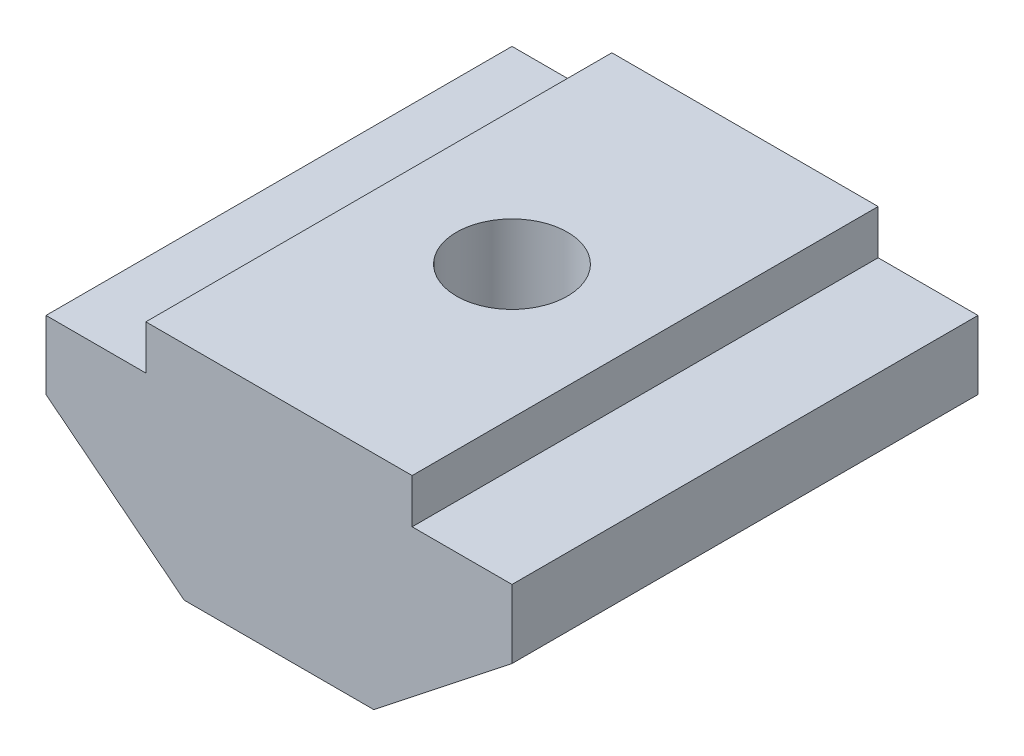
ISO-10303-21;
HEADER;
FILE_DESCRIPTION(('STEP AP214'),'2;1');
FILE_NAME('part.step','',(''),(''),'','','');
FILE_SCHEMA(('AUTOMOTIVE_DESIGN { 1 0 10303 214 1 1 1 1 }'));
ENDSEC;
DATA;
#1=APPLICATION_CONTEXT('core data for automotive mechanical design processes');
#2=APPLICATION_PROTOCOL_DEFINITION('international standard','automotive_design',2000,#1);
#3=PRODUCT_CONTEXT('',#1,'mechanical');
#4=PRODUCT('Part','Part','',(#3));
#5=PRODUCT_RELATED_PRODUCT_CATEGORY('part','',(#4));
#6=PRODUCT_DEFINITION_FORMATION('','',#4);
#7=PRODUCT_DEFINITION_CONTEXT('part definition',#1,'design');
#8=PRODUCT_DEFINITION('design','',#6,#7);
#9=PRODUCT_DEFINITION_SHAPE('','',#8);
#10=(LENGTH_UNIT() NAMED_UNIT(*) SI_UNIT(.MILLI.,.METRE.));
#11=(NAMED_UNIT(*) PLANE_ANGLE_UNIT() SI_UNIT($,.RADIAN.));
#12=(NAMED_UNIT(*) SI_UNIT($,.STERADIAN.) SOLID_ANGLE_UNIT());
#13=UNCERTAINTY_MEASURE_WITH_UNIT(LENGTH_MEASURE(1.E-05),#10,'distance_accuracy_value','');
#14=(GEOMETRIC_REPRESENTATION_CONTEXT(3) GLOBAL_UNCERTAINTY_ASSIGNED_CONTEXT((#13)) GLOBAL_UNIT_ASSIGNED_CONTEXT((#10,
#11,#12)) REPRESENTATION_CONTEXT('',''));
#15=CARTESIAN_POINT('',(0.,0.,0.));
#16=DIRECTION('',(0.,0.,1.));
#17=DIRECTION('',(1.,0.,0.));
#18=AXIS2_PLACEMENT_3D('',#15,#16,#17);
#19=CARTESIAN_POINT('',(3.,5.,10.5));
#20=DIRECTION('',(-1.,0.,0.));
#21=DIRECTION('',(0.,-1.,0.));
#22=AXIS2_PLACEMENT_3D('',#19,#20,#21);
#23=PLANE('',#22);
#24=DIRECTION('',(0.,1.,0.));
#25=VECTOR('',#24,1.);
#26=CARTESIAN_POINT('',(3.,5.,0.));
#27=LINE('',#26,#25);
#28=CARTESIAN_POINT('',(3.,4.,0.));
#29=VERTEX_POINT('',#28);
#30=CARTESIAN_POINT('',(3.,5.,0.));
#31=VERTEX_POINT('',#30);
#32=EDGE_CURVE('E158',#29,#31,#27,.T.);
#33=ORIENTED_EDGE('',*,*,#32,.T.);
#34=DIRECTION('',(0.,0.,-1.));
#35=VECTOR('',#34,1.);
#36=CARTESIAN_POINT('',(3.,5.,10.5));
#37=LINE('',#36,#35);
#38=CARTESIAN_POINT('',(3.,5.,10.5));
#39=VERTEX_POINT('',#38);
#40=EDGE_CURVE('E13',#39,#31,#37,.T.);
#41=ORIENTED_EDGE('',*,*,#40,.F.);
#42=DIRECTION('',(0.,1.,0.));
#43=VECTOR('',#42,1.);
#44=CARTESIAN_POINT('',(3.,5.,10.5));
#45=LINE('',#44,#43);
#46=CARTESIAN_POINT('',(3.,4.,10.5));
#47=VERTEX_POINT('',#46);
#48=EDGE_CURVE('E177',#47,#39,#45,.T.);
#49=ORIENTED_EDGE('',*,*,#48,.F.);
#50=DIRECTION('',(0.,0.,-1.));
#51=VECTOR('',#50,1.);
#52=CARTESIAN_POINT('',(3.,4.,10.5));
#53=LINE('',#52,#51);
#54=EDGE_CURVE('E154',#47,#29,#53,.T.);
#55=ORIENTED_EDGE('',*,*,#54,.T.);
#56=EDGE_LOOP('',(#33,#41,#49,#55));
#57=FACE_BOUND('',#56,.T.);
#58=ADVANCED_FACE('F50',(#57),#23,.F.);
#59=CARTESIAN_POINT('',(-3.,5.,10.5));
#60=DIRECTION('',(0.,-1.,0.));
#61=DIRECTION('',(0.,0.,-1.));
#62=AXIS2_PLACEMENT_3D('',#59,#60,#61);
#63=PLANE('',#62);
#64=CARTESIAN_POINT('',(0.,5.,5.24999999999998));
#65=DIRECTION('',(0.,1.,0.));
#66=DIRECTION('',(0.,0.,1.));
#67=AXIS2_PLACEMENT_3D('',#64,#65,#66);
#68=CIRCLE('',#67,1.25);
#69=CARTESIAN_POINT('',(0.,5.,6.49999999999998));
#70=VERTEX_POINT('',#69);
#71=EDGE_CURVE('E226',#70,#70,#68,.T.);
#72=ORIENTED_EDGE('',*,*,#71,.F.);
#73=EDGE_LOOP('',(#72));
#74=FACE_BOUND('',#73,.T.);
#75=DIRECTION('',(-1.,0.,0.));
#76=VECTOR('',#75,1.);
#77=CARTESIAN_POINT('',(-3.,5.,0.));
#78=LINE('',#77,#76);
#79=CARTESIAN_POINT('',(-3.,5.,0.));
#80=VERTEX_POINT('',#79);
#81=EDGE_CURVE('E161',#31,#80,#78,.T.);
#82=ORIENTED_EDGE('',*,*,#81,.T.);
#83=DIRECTION('',(0.,0.,-1.));
#84=VECTOR('',#83,1.);
#85=CARTESIAN_POINT('',(-3.,5.,10.5));
#86=LINE('',#85,#84);
#87=CARTESIAN_POINT('',(-3.,5.,10.5));
#88=VERTEX_POINT('',#87);
#89=EDGE_CURVE('E58',#88,#80,#86,.T.);
#90=ORIENTED_EDGE('',*,*,#89,.F.);
#91=DIRECTION('',(-1.,0.,0.));
#92=VECTOR('',#91,1.);
#93=CARTESIAN_POINT('',(-3.,5.,10.5));
#94=LINE('',#93,#92);
#95=EDGE_CURVE('E115',#39,#88,#94,.T.);
#96=ORIENTED_EDGE('',*,*,#95,.F.);
#97=ORIENTED_EDGE('',*,*,#40,.T.);
#98=EDGE_LOOP('',(#82,#90,#96,#97));
#99=FACE_BOUND('',#98,.T.);
#100=ADVANCED_FACE('F232',(#74,#99),#63,.F.);
#101=CARTESIAN_POINT('',(-3.,5.,10.5));
#102=DIRECTION('',(1.,0.,0.));
#103=DIRECTION('',(0.,1.,0.));
#104=AXIS2_PLACEMENT_3D('',#101,#102,#103);
#105=PLANE('',#104);
#106=DIRECTION('',(0.,-1.,0.));
#107=VECTOR('',#106,1.);
#108=CARTESIAN_POINT('',(-3.,5.,0.));
#109=LINE('',#108,#107);
#110=CARTESIAN_POINT('',(-3.,4.,0.));
#111=VERTEX_POINT('',#110);
#112=EDGE_CURVE('E164',#80,#111,#109,.T.);
#113=ORIENTED_EDGE('',*,*,#112,.T.);
#114=DIRECTION('',(0.,0.,-1.));
#115=VECTOR('',#114,1.);
#116=CARTESIAN_POINT('',(-3.,4.,10.5));
#117=LINE('',#116,#115);
#118=CARTESIAN_POINT('',(-3.,4.,10.5));
#119=VERTEX_POINT('',#118);
#120=EDGE_CURVE('E190',#119,#111,#117,.T.);
#121=ORIENTED_EDGE('',*,*,#120,.F.);
#122=DIRECTION('',(0.,-1.,0.));
#123=VECTOR('',#122,1.);
#124=CARTESIAN_POINT('',(-3.,5.,10.5));
#125=LINE('',#124,#123);
#126=EDGE_CURVE('E198',#88,#119,#125,.T.);
#127=ORIENTED_EDGE('',*,*,#126,.F.);
#128=ORIENTED_EDGE('',*,*,#89,.T.);
#129=EDGE_LOOP('',(#113,#121,#127,#128));
#130=FACE_BOUND('',#129,.T.);
#131=ADVANCED_FACE('F196',(#130),#105,.F.);
#132=CARTESIAN_POINT('',(-3.,4.,10.5));
#133=DIRECTION('',(0.,-1.,0.));
#134=DIRECTION('',(0.,0.,-1.));
#135=AXIS2_PLACEMENT_3D('',#132,#133,#134);
#136=PLANE('',#135);
#137=DIRECTION('',(-1.,0.,0.));
#138=VECTOR('',#137,1.);
#139=CARTESIAN_POINT('',(-3.,4.,0.));
#140=LINE('',#139,#138);
#141=CARTESIAN_POINT('',(-5.24999999999998,4.,0.));
#142=VERTEX_POINT('',#141);
#143=EDGE_CURVE('E166',#111,#142,#140,.T.);
#144=ORIENTED_EDGE('',*,*,#143,.T.);
#145=DIRECTION('',(0.,0.,-1.));
#146=VECTOR('',#145,1.);
#147=CARTESIAN_POINT('',(-5.24999999999998,4.,10.5));
#148=LINE('',#147,#146);
#149=CARTESIAN_POINT('',(-5.24999999999998,4.,10.5));
#150=VERTEX_POINT('',#149);
#151=EDGE_CURVE('E187',#150,#142,#148,.T.);
#152=ORIENTED_EDGE('',*,*,#151,.F.);
#153=DIRECTION('',(-1.,0.,0.));
#154=VECTOR('',#153,1.);
#155=CARTESIAN_POINT('',(-3.,4.,10.5));
#156=LINE('',#155,#154);
#157=EDGE_CURVE('E216',#119,#150,#156,.T.);
#158=ORIENTED_EDGE('',*,*,#157,.F.);
#159=ORIENTED_EDGE('',*,*,#120,.T.);
#160=EDGE_LOOP('',(#144,#152,#158,#159));
#161=FACE_BOUND('',#160,.T.);
#162=ADVANCED_FACE('F207',(#161),#136,.F.);
#163=CARTESIAN_POINT('',(-5.24999999999998,4.,10.5));
#164=DIRECTION('',(1.,0.,0.));
#165=DIRECTION('',(0.,0.,-1.));
#166=AXIS2_PLACEMENT_3D('',#163,#164,#165);
#167=PLANE('',#166);
#168=DIRECTION('',(0.,-1.,0.));
#169=VECTOR('',#168,1.);
#170=CARTESIAN_POINT('',(-5.24999999999998,4.,0.));
#171=LINE('',#170,#169);
#172=CARTESIAN_POINT('',(-5.24999999999998,2.45593869111821,0.));
#173=VERTEX_POINT('',#172);
#174=EDGE_CURVE('E168',#142,#173,#171,.T.);
#175=ORIENTED_EDGE('',*,*,#174,.T.);
#176=DIRECTION('',(0.,0.,-1.));
#177=VECTOR('',#176,1.);
#178=CARTESIAN_POINT('',(-5.24999999999998,2.45593869111821,10.5));
#179=LINE('',#178,#177);
#180=CARTESIAN_POINT('',(-5.24999999999998,2.45593869111821,10.5));
#181=VERTEX_POINT('',#180);
#182=EDGE_CURVE('E184',#181,#173,#179,.T.);
#183=ORIENTED_EDGE('',*,*,#182,.F.);
#184=DIRECTION('',(0.,-1.,0.));
#185=VECTOR('',#184,1.);
#186=CARTESIAN_POINT('',(-5.24999999999998,4.,10.5));
#187=LINE('',#186,#185);
#188=EDGE_CURVE('E213',#150,#181,#187,.T.);
#189=ORIENTED_EDGE('',*,*,#188,.F.);
#190=ORIENTED_EDGE('',*,*,#151,.T.);
#191=EDGE_LOOP('',(#175,#183,#189,#190));
#192=FACE_BOUND('',#191,.T.);
#193=ADVANCED_FACE('F211',(#192),#167,.F.);
#194=CARTESIAN_POINT('',(-5.24999999999998,2.45593869111821,10.5));
#195=DIRECTION('',(0.619208751305956,0.78522641467676,0.));
#196=DIRECTION('',(-0.78522641467676,0.619208751305956,0.));
#197=AXIS2_PLACEMENT_3D('',#194,#195,#196);
#198=PLANE('',#197);
#199=DIRECTION('',(0.78522641467676,-0.619208751305956,0.));
#200=VECTOR('',#199,1.);
#201=CARTESIAN_POINT('',(-5.24999999999998,2.45593869111821,0.));
#202=LINE('',#201,#200);
#203=CARTESIAN_POINT('',(-2.13559322033896,0.,0.));
#204=VERTEX_POINT('',#203);
#205=EDGE_CURVE('E170',#173,#204,#202,.T.);
#206=ORIENTED_EDGE('',*,*,#205,.T.);
#207=DIRECTION('',(0.,0.,-1.));
#208=VECTOR('',#207,1.);
#209=CARTESIAN_POINT('',(-2.13559322033896,0.,10.5));
#210=LINE('',#209,#208);
#211=CARTESIAN_POINT('',(-2.13559322033896,0.,10.5));
#212=VERTEX_POINT('',#211);
#213=EDGE_CURVE('E181',#212,#204,#210,.T.);
#214=ORIENTED_EDGE('',*,*,#213,.F.);
#215=DIRECTION('',(0.78522641467676,-0.619208751305956,0.));
#216=VECTOR('',#215,1.);
#217=CARTESIAN_POINT('',(-5.24999999999998,2.45593869111821,10.5));
#218=LINE('',#217,#216);
#219=EDGE_CURVE('E215',#181,#212,#218,.T.);
#220=ORIENTED_EDGE('',*,*,#219,.F.);
#221=ORIENTED_EDGE('',*,*,#182,.T.);
#222=EDGE_LOOP('',(#206,#214,#220,#221));
#223=FACE_BOUND('',#222,.T.);
#224=ADVANCED_FACE('F242',(#223),#198,.F.);
#225=CARTESIAN_POINT('',(2.13559322033896,0.,10.5));
#226=DIRECTION('',(0.,1.,0.));
#227=DIRECTION('',(0.,0.,1.));
#228=AXIS2_PLACEMENT_3D('',#225,#226,#227);
#229=PLANE('',#228);
#230=CARTESIAN_POINT('',(0.,0.,5.24999999999998));
#231=DIRECTION('',(0.,1.,0.));
#232=DIRECTION('',(0.,0.,1.));
#233=AXIS2_PLACEMENT_3D('',#230,#231,#232);
#234=CIRCLE('',#233,1.25);
#235=CARTESIAN_POINT('',(0.,0.,6.49999999999997));
#236=VERTEX_POINT('',#235);
#237=EDGE_CURVE('E162',#236,#236,#234,.T.);
#238=ORIENTED_EDGE('',*,*,#237,.T.);
#239=EDGE_LOOP('',(#238));
#240=FACE_BOUND('',#239,.T.);
#241=DIRECTION('',(1.,0.,0.));
#242=VECTOR('',#241,1.);
#243=CARTESIAN_POINT('',(2.13559322033896,0.,0.));
#244=LINE('',#243,#242);
#245=CARTESIAN_POINT('',(2.13559322033896,0.,0.));
#246=VERTEX_POINT('',#245);
#247=EDGE_CURVE('E172',#204,#246,#244,.T.);
#248=ORIENTED_EDGE('',*,*,#247,.T.);
#249=DIRECTION('',(0.,0.,-1.));
#250=VECTOR('',#249,1.);
#251=CARTESIAN_POINT('',(2.13559322033896,0.,10.5));
#252=LINE('',#251,#250);
#253=CARTESIAN_POINT('',(2.13559322033896,0.,10.5));
#254=VERTEX_POINT('',#253);
#255=EDGE_CURVE('E149',#254,#246,#252,.T.);
#256=ORIENTED_EDGE('',*,*,#255,.F.);
#257=DIRECTION('',(1.,0.,0.));
#258=VECTOR('',#257,1.);
#259=CARTESIAN_POINT('',(2.13559322033896,0.,10.5));
#260=LINE('',#259,#258);
#261=EDGE_CURVE('E140',#212,#254,#260,.T.);
#262=ORIENTED_EDGE('',*,*,#261,.F.);
#263=ORIENTED_EDGE('',*,*,#213,.T.);
#264=EDGE_LOOP('',(#248,#256,#262,#263));
#265=FACE_BOUND('',#264,.T.);
#266=ADVANCED_FACE('F239',(#240,#265),#229,.F.);
#267=CARTESIAN_POINT('',(5.24999999999998,2.45593869111821,10.5));
#268=DIRECTION('',(-0.619208751305956,0.78522641467676,0.));
#269=DIRECTION('',(-0.78522641467676,-0.619208751305956,0.));
#270=AXIS2_PLACEMENT_3D('',#267,#268,#269);
#271=PLANE('',#270);
#272=DIRECTION('',(0.78522641467676,0.619208751305956,0.));
#273=VECTOR('',#272,1.);
#274=CARTESIAN_POINT('',(5.24999999999998,2.45593869111821,0.));
#275=LINE('',#274,#273);
#276=CARTESIAN_POINT('',(5.24999999999998,2.45593869111821,0.));
#277=VERTEX_POINT('',#276);
#278=EDGE_CURVE('E148',#246,#277,#275,.T.);
#279=ORIENTED_EDGE('',*,*,#278,.T.);
#280=DIRECTION('',(0.,0.,-1.));
#281=VECTOR('',#280,1.);
#282=CARTESIAN_POINT('',(5.24999999999998,2.45593869111821,10.5));
#283=LINE('',#282,#281);
#284=CARTESIAN_POINT('',(5.24999999999998,2.45593869111821,10.5));
#285=VERTEX_POINT('',#284);
#286=EDGE_CURVE('E145',#285,#277,#283,.T.);
#287=ORIENTED_EDGE('',*,*,#286,.F.);
#288=DIRECTION('',(0.78522641467676,0.619208751305956,0.));
#289=VECTOR('',#288,1.);
#290=CARTESIAN_POINT('',(5.24999999999998,2.45593869111821,10.5));
#291=LINE('',#290,#289);
#292=EDGE_CURVE('E134',#254,#285,#291,.T.);
#293=ORIENTED_EDGE('',*,*,#292,.F.);
#294=ORIENTED_EDGE('',*,*,#255,.T.);
#295=EDGE_LOOP('',(#279,#287,#293,#294));
#296=FACE_BOUND('',#295,.T.);
#297=ADVANCED_FACE('F146',(#296),#271,.F.);
#298=CARTESIAN_POINT('',(5.24999999999998,4.,10.5));
#299=DIRECTION('',(-1.,0.,0.));
#300=DIRECTION('',(0.,0.,1.));
#301=AXIS2_PLACEMENT_3D('',#298,#299,#300);
#302=PLANE('',#301);
#303=DIRECTION('',(0.,1.,0.));
#304=VECTOR('',#303,1.);
#305=CARTESIAN_POINT('',(5.24999999999998,4.,0.));
#306=LINE('',#305,#304);
#307=CARTESIAN_POINT('',(5.24999999999998,4.,0.));
#308=VERTEX_POINT('',#307);
#309=EDGE_CURVE('E101',#277,#308,#306,.T.);
#310=ORIENTED_EDGE('',*,*,#309,.T.);
#311=DIRECTION('',(0.,0.,-1.));
#312=VECTOR('',#311,1.);
#313=CARTESIAN_POINT('',(5.24999999999998,4.,10.5));
#314=LINE('',#313,#312);
#315=CARTESIAN_POINT('',(5.24999999999998,4.,10.5));
#316=VERTEX_POINT('',#315);
#317=EDGE_CURVE('E150',#316,#308,#314,.T.);
#318=ORIENTED_EDGE('',*,*,#317,.F.);
#319=DIRECTION('',(0.,1.,0.));
#320=VECTOR('',#319,1.);
#321=CARTESIAN_POINT('',(5.24999999999998,4.,10.5));
#322=LINE('',#321,#320);
#323=EDGE_CURVE('E138',#285,#316,#322,.T.);
#324=ORIENTED_EDGE('',*,*,#323,.F.);
#325=ORIENTED_EDGE('',*,*,#286,.T.);
#326=EDGE_LOOP('',(#310,#318,#324,#325));
#327=FACE_BOUND('',#326,.T.);
#328=ADVANCED_FACE('F152',(#327),#302,.F.);
#329=CARTESIAN_POINT('',(3.,4.,10.5));
#330=DIRECTION('',(0.,-1.,0.));
#331=DIRECTION('',(0.,0.,-1.));
#332=AXIS2_PLACEMENT_3D('',#329,#330,#331);
#333=PLANE('',#332);
#334=DIRECTION('',(-1.,0.,0.));
#335=VECTOR('',#334,1.);
#336=CARTESIAN_POINT('',(3.,4.,0.));
#337=LINE('',#336,#335);
#338=EDGE_CURVE('E107',#308,#29,#337,.T.);
#339=ORIENTED_EDGE('',*,*,#338,.T.);
#340=ORIENTED_EDGE('',*,*,#54,.F.);
#341=DIRECTION('',(-1.,0.,0.));
#342=VECTOR('',#341,1.);
#343=CARTESIAN_POINT('',(3.,4.,10.5));
#344=LINE('',#343,#342);
#345=EDGE_CURVE('E66',#316,#47,#344,.T.);
#346=ORIENTED_EDGE('',*,*,#345,.F.);
#347=ORIENTED_EDGE('',*,*,#317,.T.);
#348=EDGE_LOOP('',(#339,#340,#346,#347));
#349=FACE_BOUND('',#348,.T.);
#350=ADVANCED_FACE('F295',(#349),#333,.F.);
#351=CARTESIAN_POINT('',(0.,0.,10.5));
#352=DIRECTION('',(0.,0.,1.));
#353=DIRECTION('',(1.,0.,0.));
#354=AXIS2_PLACEMENT_3D('',#351,#352,#353);
#355=PLANE('',#354);
#356=ORIENTED_EDGE('',*,*,#48,.T.);
#357=ORIENTED_EDGE('',*,*,#95,.T.);
#358=ORIENTED_EDGE('',*,*,#126,.T.);
#359=ORIENTED_EDGE('',*,*,#157,.T.);
#360=ORIENTED_EDGE('',*,*,#188,.T.);
#361=ORIENTED_EDGE('',*,*,#219,.T.);
#362=ORIENTED_EDGE('',*,*,#261,.T.);
#363=ORIENTED_EDGE('',*,*,#292,.T.);
#364=ORIENTED_EDGE('',*,*,#323,.T.);
#365=ORIENTED_EDGE('',*,*,#345,.T.);
#366=EDGE_LOOP('',(#356,#357,#358,#359,#360,#361,#362,#363,#364,#365));
#367=FACE_BOUND('',#366,.T.);
#368=ADVANCED_FACE('F136',(#367),#355,.T.);
#369=CARTESIAN_POINT('',(0.,0.,0.));
#370=DIRECTION('',(0.,0.,1.));
#371=DIRECTION('',(1.,0.,0.));
#372=AXIS2_PLACEMENT_3D('',#369,#370,#371);
#373=PLANE('',#372);
#374=ORIENTED_EDGE('',*,*,#32,.F.);
#375=ORIENTED_EDGE('',*,*,#338,.F.);
#376=ORIENTED_EDGE('',*,*,#309,.F.);
#377=ORIENTED_EDGE('',*,*,#278,.F.);
#378=ORIENTED_EDGE('',*,*,#247,.F.);
#379=ORIENTED_EDGE('',*,*,#205,.F.);
#380=ORIENTED_EDGE('',*,*,#174,.F.);
#381=ORIENTED_EDGE('',*,*,#143,.F.);
#382=ORIENTED_EDGE('',*,*,#112,.F.);
#383=ORIENTED_EDGE('',*,*,#81,.F.);
#384=EDGE_LOOP('',(#374,#375,#376,#377,#378,#379,#380,#381,#382,#383));
#385=FACE_BOUND('',#384,.T.);
#386=ADVANCED_FACE('F202',(#385),#373,.F.);
#387=CARTESIAN_POINT('',(0.,5.,5.24999999999998));
#388=DIRECTION('',(0.,1.,0.));
#389=DIRECTION('',(0.,0.,1.));
#390=AXIS2_PLACEMENT_3D('',#387,#388,#389);
#391=CYLINDRICAL_SURFACE('',#390,1.25);
#392=ORIENTED_EDGE('',*,*,#237,.F.);
#393=EDGE_LOOP('',(#392));
#394=FACE_BOUND('',#393,.T.);
#395=ORIENTED_EDGE('',*,*,#71,.T.);
#396=EDGE_LOOP('',(#395));
#397=FACE_BOUND('',#396,.T.);
#398=ADVANCED_FACE('F230',(#394,#397),#391,.F.);
#399=CLOSED_SHELL('',(#58,#100,#131,#162,#193,#224,#266,#297,#328,#350,#368,#386,#398));
#400=MANIFOLD_SOLID_BREP('B2',#399);
#401=ADVANCED_BREP_SHAPE_REPRESENTATION('',(#18,#400),#14);
#402=SHAPE_DEFINITION_REPRESENTATION(#9,#401);
ENDSEC;
END-ISO-10303-21;
